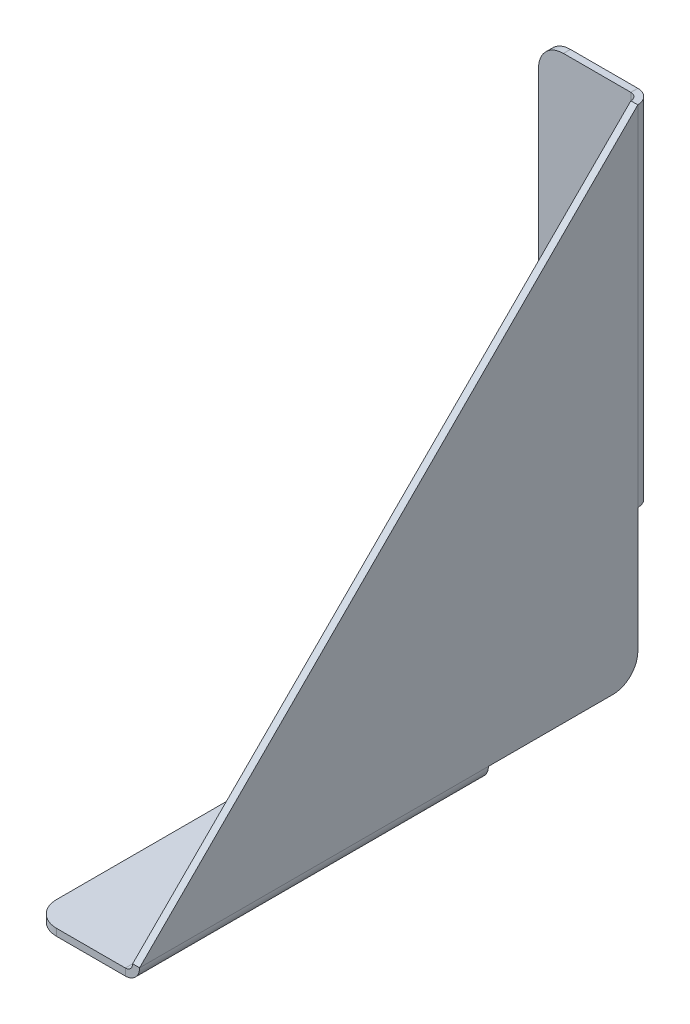
ISO-10303-21;
HEADER;
FILE_DESCRIPTION(('STEP AP214'),'2;1');
FILE_NAME('part.step','',(''),(''),'','','');
FILE_SCHEMA(('AUTOMOTIVE_DESIGN { 1 0 10303 214 1 1 1 1 }'));
ENDSEC;
DATA;
#1=APPLICATION_CONTEXT('core data for automotive mechanical design processes');
#2=APPLICATION_PROTOCOL_DEFINITION('international standard','automotive_design',2000,#1);
#3=PRODUCT_CONTEXT('',#1,'mechanical');
#4=PRODUCT('Part','Part','',(#3));
#5=PRODUCT_RELATED_PRODUCT_CATEGORY('part','',(#4));
#6=PRODUCT_DEFINITION_FORMATION('','',#4);
#7=PRODUCT_DEFINITION_CONTEXT('part definition',#1,'design');
#8=PRODUCT_DEFINITION('design','',#6,#7);
#9=PRODUCT_DEFINITION_SHAPE('','',#8);
#10=(LENGTH_UNIT() NAMED_UNIT(*) SI_UNIT(.MILLI.,.METRE.));
#11=(NAMED_UNIT(*) PLANE_ANGLE_UNIT() SI_UNIT($,.RADIAN.));
#12=(NAMED_UNIT(*) SI_UNIT($,.STERADIAN.) SOLID_ANGLE_UNIT());
#13=UNCERTAINTY_MEASURE_WITH_UNIT(LENGTH_MEASURE(1.E-05),#10,'distance_accuracy_value','');
#14=(GEOMETRIC_REPRESENTATION_CONTEXT(3) GLOBAL_UNCERTAINTY_ASSIGNED_CONTEXT((#13)) GLOBAL_UNIT_ASSIGNED_CONTEXT((#10,
#11,#12)) REPRESENTATION_CONTEXT('',''));
#15=CARTESIAN_POINT('',(0.,0.,0.));
#16=DIRECTION('',(0.,0.,1.));
#17=DIRECTION('',(1.,0.,0.));
#18=AXIS2_PLACEMENT_3D('',#15,#16,#17);
#19=CARTESIAN_POINT('',(-0.7,50.,-50.));
#20=DIRECTION('',(0.,0.,-1.));
#21=DIRECTION('',(0.,1.,0.));
#22=AXIS2_PLACEMENT_3D('',#19,#20,#21);
#23=PLANE('',#22);
#24=DIRECTION('',(0.,1.,0.));
#25=VECTOR('',#24,1.);
#26=CARTESIAN_POINT('',(0.,50.,-50.));
#27=LINE('',#26,#25);
#28=CARTESIAN_POINT('',(0.,2.5,-50.));
#29=VERTEX_POINT('',#28);
#30=CARTESIAN_POINT('',(0.,15.,-50.));
#31=VERTEX_POINT('',#30);
#32=EDGE_CURVE('E301',#29,#31,#27,.T.);
#33=ORIENTED_EDGE('',*,*,#32,.F.);
#34=DIRECTION('',(1.,0.,0.));
#35=VECTOR('',#34,1.);
#36=CARTESIAN_POINT('',(-0.7,2.5,-50.));
#37=LINE('',#36,#35);
#38=CARTESIAN_POINT('',(-0.7,2.5,-50.));
#39=VERTEX_POINT('',#38);
#40=EDGE_CURVE('E434',#29,#39,#37,.F.);
#41=ORIENTED_EDGE('',*,*,#40,.T.);
#42=DIRECTION('',(0.,1.,0.));
#43=VECTOR('',#42,1.);
#44=CARTESIAN_POINT('',(-0.7,50.,-50.));
#45=LINE('',#44,#43);
#46=CARTESIAN_POINT('',(-0.699999999999998,15.,-50.));
#47=VERTEX_POINT('',#46);
#48=EDGE_CURVE('E431',#39,#47,#45,.T.);
#49=ORIENTED_EDGE('',*,*,#48,.T.);
#50=DIRECTION('',(1.,0.,0.));
#51=VECTOR('',#50,1.);
#52=CARTESIAN_POINT('',(-0.699999999999998,15.,-50.));
#53=LINE('',#52,#51);
#54=EDGE_CURVE('E330',#47,#31,#53,.T.);
#55=ORIENTED_EDGE('',*,*,#54,.T.);
#56=EDGE_LOOP('',(#33,#41,#49,#55));
#57=FACE_BOUND('',#56,.T.);
#58=ADVANCED_FACE('F76',(#57),#23,.T.);
#59=CARTESIAN_POINT('',(-0.7,0.,-50.));
#60=DIRECTION('',(0.,-1.,0.));
#61=DIRECTION('',(0.,0.,-1.));
#62=AXIS2_PLACEMENT_3D('',#59,#60,#61);
#63=PLANE('',#62);
#64=DIRECTION('',(0.,0.,-1.));
#65=VECTOR('',#64,1.);
#66=CARTESIAN_POINT('',(-0.7,0.,-50.));
#67=LINE('',#66,#65);
#68=CARTESIAN_POINT('',(-0.7,0.,-35.));
#69=VERTEX_POINT('',#68);
#70=CARTESIAN_POINT('',(-0.7,0.,-47.5));
#71=VERTEX_POINT('',#70);
#72=EDGE_CURVE('E313',#69,#71,#67,.T.);
#73=ORIENTED_EDGE('',*,*,#72,.T.);
#74=DIRECTION('',(1.,0.,0.));
#75=VECTOR('',#74,1.);
#76=CARTESIAN_POINT('',(-0.7,0.,-47.5));
#77=LINE('',#76,#75);
#78=CARTESIAN_POINT('',(0.,0.,-47.5));
#79=VERTEX_POINT('',#78);
#80=EDGE_CURVE('E297',#71,#79,#77,.T.);
#81=ORIENTED_EDGE('',*,*,#80,.T.);
#82=DIRECTION('',(0.,0.,-1.));
#83=VECTOR('',#82,1.);
#84=CARTESIAN_POINT('',(0.,0.,-50.));
#85=LINE('',#84,#83);
#86=CARTESIAN_POINT('',(0.,0.,-35.));
#87=VERTEX_POINT('',#86);
#88=EDGE_CURVE('E334',#87,#79,#85,.T.);
#89=ORIENTED_EDGE('',*,*,#88,.F.);
#90=DIRECTION('',(1.,0.,0.));
#91=VECTOR('',#90,1.);
#92=CARTESIAN_POINT('',(-0.699999999999994,0.,-35.));
#93=LINE('',#92,#91);
#94=EDGE_CURVE('E264',#69,#87,#93,.T.);
#95=ORIENTED_EDGE('',*,*,#94,.F.);
#96=EDGE_LOOP('',(#73,#81,#89,#95));
#97=FACE_BOUND('',#96,.T.);
#98=ADVANCED_FACE('F455',(#97),#63,.T.);
#99=CARTESIAN_POINT('',(-0.7,0.,0.));
#100=DIRECTION('',(0.,0.707106781186547,0.707106781186548));
#101=DIRECTION('',(0.,-0.707106781186548,0.707106781186547));
#102=AXIS2_PLACEMENT_3D('',#99,#100,#101);
#103=PLANE('',#102);
#104=DIRECTION('',(0.,-0.707106781186548,0.707106781186547));
#105=VECTOR('',#104,1.);
#106=CARTESIAN_POINT('',(0.,0.,0.));
#107=LINE('',#106,#105);
#108=CARTESIAN_POINT('',(0.,50.,-50.));
#109=VERTEX_POINT('',#108);
#110=CARTESIAN_POINT('',(0.,0.,0.));
#111=VERTEX_POINT('',#110);
#112=EDGE_CURVE('E304',#109,#111,#107,.T.);
#113=ORIENTED_EDGE('',*,*,#112,.F.);
#114=DIRECTION('',(1.,0.,0.));
#115=VECTOR('',#114,1.);
#116=CARTESIAN_POINT('',(-0.7,50.,-50.));
#117=LINE('',#116,#115);
#118=CARTESIAN_POINT('',(-0.700000000000008,50.,-50.));
#119=VERTEX_POINT('',#118);
#120=EDGE_CURVE('E315',#119,#109,#117,.T.);
#121=ORIENTED_EDGE('',*,*,#120,.F.);
#122=DIRECTION('',(0.,-0.707106781186548,0.707106781186547));
#123=VECTOR('',#122,1.);
#124=CARTESIAN_POINT('',(-0.7,0.,0.));
#125=LINE('',#124,#123);
#126=CARTESIAN_POINT('',(-0.7,0.,0.));
#127=VERTEX_POINT('',#126);
#128=EDGE_CURVE('E317',#119,#127,#125,.T.);
#129=ORIENTED_EDGE('',*,*,#128,.T.);
#130=DIRECTION('',(1.,0.,0.));
#131=VECTOR('',#130,1.);
#132=CARTESIAN_POINT('',(-0.7,0.,0.));
#133=LINE('',#132,#131);
#134=EDGE_CURVE('E283',#127,#111,#133,.T.);
#135=ORIENTED_EDGE('',*,*,#134,.T.);
#136=EDGE_LOOP('',(#113,#121,#129,#135));
#137=FACE_BOUND('',#136,.T.);
#138=ADVANCED_FACE('F425',(#137),#103,.T.);
#139=CARTESIAN_POINT('',(-0.7,0.,0.));
#140=DIRECTION('',(1.,0.,0.));
#141=DIRECTION('',(0.,0.,-1.));
#142=AXIS2_PLACEMENT_3D('',#139,#140,#141);
#143=PLANE('',#142);
#144=ORIENTED_EDGE('',*,*,#48,.F.);
#145=CARTESIAN_POINT('',(-0.7,2.5,-47.5));
#146=DIRECTION('',(1.,0.,0.));
#147=DIRECTION('',(0.,0.,-1.));
#148=AXIS2_PLACEMENT_3D('',#145,#146,#147);
#149=CIRCLE('',#148,2.5);
#150=EDGE_CURVE('E436',#39,#71,#149,.F.);
#151=ORIENTED_EDGE('',*,*,#150,.T.);
#152=ORIENTED_EDGE('',*,*,#72,.F.);
#153=EDGE_CURVE('E269',#127,#69,#67,.T.);
#154=ORIENTED_EDGE('',*,*,#153,.F.);
#155=ORIENTED_EDGE('',*,*,#128,.F.);
#156=DIRECTION('',(0.,-1.,0.));
#157=VECTOR('',#156,1.);
#158=CARTESIAN_POINT('',(-0.699999999999998,15.,-50.));
#159=LINE('',#158,#157);
#160=EDGE_CURVE('E351',#47,#119,#159,.F.);
#161=ORIENTED_EDGE('',*,*,#160,.F.);
#162=EDGE_LOOP('',(#144,#151,#152,#154,#155,#161));
#163=FACE_BOUND('',#162,.T.);
#164=ADVANCED_FACE('F428',(#163),#143,.F.);
#165=CARTESIAN_POINT('',(0.,0.,0.));
#166=DIRECTION('',(1.,0.,0.));
#167=DIRECTION('',(0.,0.,-1.));
#168=AXIS2_PLACEMENT_3D('',#165,#166,#167);
#169=PLANE('',#168);
#170=ORIENTED_EDGE('',*,*,#88,.T.);
#171=CARTESIAN_POINT('',(0.,2.5,-47.5));
#172=DIRECTION('',(1.,0.,0.));
#173=DIRECTION('',(0.,0.,-1.));
#174=AXIS2_PLACEMENT_3D('',#171,#172,#173);
#175=CIRCLE('',#174,2.5);
#176=EDGE_CURVE('E300',#79,#29,#175,.T.);
#177=ORIENTED_EDGE('',*,*,#176,.T.);
#178=ORIENTED_EDGE('',*,*,#32,.T.);
#179=DIRECTION('',(0.,-1.,0.));
#180=VECTOR('',#179,1.);
#181=CARTESIAN_POINT('',(0.,15.,-50.));
#182=LINE('',#181,#180);
#183=EDGE_CURVE('E321',#31,#109,#182,.F.);
#184=ORIENTED_EDGE('',*,*,#183,.T.);
#185=ORIENTED_EDGE('',*,*,#112,.T.);
#186=EDGE_CURVE('E212',#111,#87,#85,.T.);
#187=ORIENTED_EDGE('',*,*,#186,.T.);
#188=EDGE_LOOP('',(#170,#177,#178,#184,#185,#187));
#189=FACE_BOUND('',#188,.T.);
#190=ADVANCED_FACE('F637',(#189),#169,.T.);
#191=CARTESIAN_POINT('',(-1.4366,50.,-50.));
#192=DIRECTION('',(0.,1.,0.));
#193=DIRECTION('',(-1.,0.,0.));
#194=AXIS2_PLACEMENT_3D('',#191,#192,#193);
#195=PLANE('',#194);
#196=DIRECTION('',(0.,0.,-1.));
#197=VECTOR('',#196,1.);
#198=CARTESIAN_POINT('',(-1.4366,50.,-51.4366));
#199=LINE('',#198,#197);
#200=CARTESIAN_POINT('',(-1.4366,50.,-50.7366));
#201=VERTEX_POINT('',#200);
#202=CARTESIAN_POINT('',(-1.43659999999999,50.,-51.4366));
#203=VERTEX_POINT('',#202);
#204=EDGE_CURVE('E268',#201,#203,#199,.T.);
#205=ORIENTED_EDGE('',*,*,#204,.F.);
#206=CARTESIAN_POINT('',(-1.4366,50.,-50.));
#207=DIRECTION('',(0.,-1.,0.));
#208=DIRECTION('',(1.,0.,0.));
#209=AXIS2_PLACEMENT_3D('',#206,#207,#208);
#210=CIRCLE('',#209,0.73659999999999);
#211=EDGE_CURVE('E322',#119,#201,#210,.F.);
#212=ORIENTED_EDGE('',*,*,#211,.F.);
#213=ORIENTED_EDGE('',*,*,#120,.T.);
#214=CARTESIAN_POINT('',(-1.4366,50.,-50.));
#215=DIRECTION('',(0.,-1.,0.));
#216=DIRECTION('',(1.,0.,0.));
#217=AXIS2_PLACEMENT_3D('',#214,#215,#216);
#218=CIRCLE('',#217,1.43659999999999);
#219=EDGE_CURVE('E327',#109,#203,#218,.F.);
#220=ORIENTED_EDGE('',*,*,#219,.T.);
#221=EDGE_LOOP('',(#205,#212,#213,#220));
#222=FACE_BOUND('',#221,.T.);
#223=ADVANCED_FACE('F390',(#222),#195,.T.);
#224=CARTESIAN_POINT('',(-1.43659999999999,15.,-50.));
#225=DIRECTION('',(0.,1.,0.));
#226=DIRECTION('',(-1.,0.,0.));
#227=AXIS2_PLACEMENT_3D('',#224,#225,#226);
#228=PLANE('',#227);
#229=CARTESIAN_POINT('',(-1.43659999999999,15.,-50.));
#230=DIRECTION('',(0.,-1.,0.));
#231=DIRECTION('',(1.,0.,0.));
#232=AXIS2_PLACEMENT_3D('',#229,#230,#231);
#233=CIRCLE('',#232,0.73659999999999);
#234=CARTESIAN_POINT('',(-1.43659999999999,15.,-50.7366));
#235=VERTEX_POINT('',#234);
#236=EDGE_CURVE('E335',#235,#47,#233,.T.);
#237=ORIENTED_EDGE('',*,*,#236,.F.);
#238=DIRECTION('',(0.,0.,-1.));
#239=VECTOR('',#238,1.);
#240=CARTESIAN_POINT('',(-1.43659999999999,15.,-50.7366));
#241=LINE('',#240,#239);
#242=CARTESIAN_POINT('',(-1.43659999999999,15.,-51.4366));
#243=VERTEX_POINT('',#242);
#244=EDGE_CURVE('E381',#235,#243,#241,.T.);
#245=ORIENTED_EDGE('',*,*,#244,.T.);
#246=CARTESIAN_POINT('',(-1.43659999999999,15.,-50.));
#247=DIRECTION('',(0.,-1.,0.));
#248=DIRECTION('',(1.,0.,0.));
#249=AXIS2_PLACEMENT_3D('',#246,#247,#248);
#250=CIRCLE('',#249,1.43659999999999);
#251=EDGE_CURVE('E318',#243,#31,#250,.T.);
#252=ORIENTED_EDGE('',*,*,#251,.T.);
#253=ORIENTED_EDGE('',*,*,#54,.F.);
#254=EDGE_LOOP('',(#237,#245,#252,#253));
#255=FACE_BOUND('',#254,.T.);
#256=ADVANCED_FACE('F403',(#255),#228,.F.);
#257=CARTESIAN_POINT('',(-1.43659999999999,15.,-50.));
#258=DIRECTION('',(0.,-1.,0.));
#259=DIRECTION('',(0.,0.,-1.));
#260=AXIS2_PLACEMENT_3D('',#257,#258,#259);
#261=CYLINDRICAL_SURFACE('',#260,1.43659999999999);
#262=ORIENTED_EDGE('',*,*,#183,.F.);
#263=ORIENTED_EDGE('',*,*,#251,.F.);
#264=DIRECTION('',(0.,-1.,0.));
#265=VECTOR('',#264,1.);
#266=CARTESIAN_POINT('',(-1.43659999999999,0.,-51.4366));
#267=LINE('',#266,#265);
#268=EDGE_CURVE('E378',#203,#243,#267,.T.);
#269=ORIENTED_EDGE('',*,*,#268,.F.);
#270=ORIENTED_EDGE('',*,*,#219,.F.);
#271=EDGE_LOOP('',(#262,#263,#269,#270));
#272=FACE_BOUND('',#271,.T.);
#273=ADVANCED_FACE('F400',(#272),#261,.T.);
#274=CARTESIAN_POINT('',(-1.43659999999999,15.,-50.));
#275=DIRECTION('',(0.,-1.,0.));
#276=DIRECTION('',(0.,0.,-1.));
#277=AXIS2_PLACEMENT_3D('',#274,#275,#276);
#278=CYLINDRICAL_SURFACE('',#277,0.73659999999999);
#279=ORIENTED_EDGE('',*,*,#160,.T.);
#280=ORIENTED_EDGE('',*,*,#211,.T.);
#281=DIRECTION('',(0.,1.,0.));
#282=VECTOR('',#281,1.);
#283=CARTESIAN_POINT('',(-1.4366,50.,-50.7366));
#284=LINE('',#283,#282);
#285=EDGE_CURVE('E384',#201,#235,#284,.F.);
#286=ORIENTED_EDGE('',*,*,#285,.T.);
#287=ORIENTED_EDGE('',*,*,#236,.T.);
#288=EDGE_LOOP('',(#279,#280,#286,#287));
#289=FACE_BOUND('',#288,.T.);
#290=ADVANCED_FACE('F420',(#289),#278,.F.);
#291=CARTESIAN_POINT('',(-0.699999999999991,15.,-51.4366));
#292=DIRECTION('',(0.,-1.,0.));
#293=DIRECTION('',(0.,0.,-1.));
#294=AXIS2_PLACEMENT_3D('',#291,#292,#293);
#295=PLANE('',#294);
#296=DIRECTION('',(-1.,0.,0.));
#297=VECTOR('',#296,1.);
#298=CARTESIAN_POINT('',(1.73472347597681E-13,15.,-50.7366));
#299=LINE('',#298,#297);
#300=CARTESIAN_POINT('',(-8.2,15.,-50.7366));
#301=VERTEX_POINT('',#300);
#302=EDGE_CURVE('E368',#301,#235,#299,.F.);
#303=ORIENTED_EDGE('',*,*,#302,.F.);
#304=DIRECTION('',(0.,0.,1.));
#305=VECTOR('',#304,1.);
#306=CARTESIAN_POINT('',(-8.2,15.,-51.4366));
#307=LINE('',#306,#305);
#308=CARTESIAN_POINT('',(-8.2,15.,-51.4366));
#309=VERTEX_POINT('',#308);
#310=EDGE_CURVE('E99',#301,#309,#307,.F.);
#311=ORIENTED_EDGE('',*,*,#310,.T.);
#312=DIRECTION('',(1.,0.,0.));
#313=VECTOR('',#312,1.);
#314=CARTESIAN_POINT('',(-0.699999999999991,15.,-51.4366));
#315=LINE('',#314,#313);
#316=EDGE_CURVE('E261',#309,#243,#315,.T.);
#317=ORIENTED_EDGE('',*,*,#316,.T.);
#318=ORIENTED_EDGE('',*,*,#244,.F.);
#319=EDGE_LOOP('',(#303,#311,#317,#318));
#320=FACE_BOUND('',#319,.T.);
#321=ADVANCED_FACE('F404',(#320),#295,.T.);
#322=CARTESIAN_POINT('',(-10.7,50.,-51.4366));
#323=DIRECTION('',(0.,1.,0.));
#324=DIRECTION('',(0.,0.,1.));
#325=AXIS2_PLACEMENT_3D('',#322,#323,#324);
#326=PLANE('',#325);
#327=DIRECTION('',(-1.,0.,0.));
#328=VECTOR('',#327,1.);
#329=CARTESIAN_POINT('',(-10.7,50.,-51.4366));
#330=LINE('',#329,#328);
#331=CARTESIAN_POINT('',(-8.2,50.,-51.4366));
#332=VERTEX_POINT('',#331);
#333=EDGE_CURVE('E364',#203,#332,#330,.T.);
#334=ORIENTED_EDGE('',*,*,#333,.T.);
#335=DIRECTION('',(0.,0.,1.));
#336=VECTOR('',#335,1.);
#337=CARTESIAN_POINT('',(-8.2,50.,-51.4366));
#338=LINE('',#337,#336);
#339=CARTESIAN_POINT('',(-8.2,50.,-50.7366));
#340=VERTEX_POINT('',#339);
#341=EDGE_CURVE('E13',#332,#340,#338,.T.);
#342=ORIENTED_EDGE('',*,*,#341,.T.);
#343=DIRECTION('',(1.,0.,0.));
#344=VECTOR('',#343,1.);
#345=CARTESIAN_POINT('',(1.73472347597681E-13,50.,-50.7366));
#346=LINE('',#345,#344);
#347=EDGE_CURVE('E375',#201,#340,#346,.F.);
#348=ORIENTED_EDGE('',*,*,#347,.F.);
#349=ORIENTED_EDGE('',*,*,#204,.T.);
#350=EDGE_LOOP('',(#334,#342,#348,#349));
#351=FACE_BOUND('',#350,.T.);
#352=ADVANCED_FACE('F396',(#351),#326,.T.);
#353=CARTESIAN_POINT('',(1.75916384534871E-13,0.,-51.4366));
#354=DIRECTION('',(0.,0.,-1.));
#355=DIRECTION('',(-1.,0.,0.));
#356=AXIS2_PLACEMENT_3D('',#353,#354,#355);
#357=PLANE('',#356);
#358=ORIENTED_EDGE('',*,*,#316,.F.);
#359=CARTESIAN_POINT('',(-8.2,17.5,-51.4366));
#360=DIRECTION('',(0.,0.,-1.));
#361=DIRECTION('',(-1.,0.,0.));
#362=AXIS2_PLACEMENT_3D('',#359,#360,#361);
#363=CIRCLE('',#362,2.5);
#364=CARTESIAN_POINT('',(-10.7,17.5,-51.4366));
#365=VERTEX_POINT('',#364);
#366=EDGE_CURVE('E84',#309,#365,#363,.T.);
#367=ORIENTED_EDGE('',*,*,#366,.T.);
#368=DIRECTION('',(0.,-1.,0.));
#369=VECTOR('',#368,1.);
#370=CARTESIAN_POINT('',(-10.7,15.,-51.4366));
#371=LINE('',#370,#369);
#372=CARTESIAN_POINT('',(-10.7,47.5,-51.4366));
#373=VERTEX_POINT('',#372);
#374=EDGE_CURVE('E360',#373,#365,#371,.T.);
#375=ORIENTED_EDGE('',*,*,#374,.F.);
#376=CARTESIAN_POINT('',(-8.2,47.5,-51.4366));
#377=DIRECTION('',(0.,0.,-1.));
#378=DIRECTION('',(-1.,0.,0.));
#379=AXIS2_PLACEMENT_3D('',#376,#377,#378);
#380=CIRCLE('',#379,2.5);
#381=EDGE_CURVE('E91',#373,#332,#380,.T.);
#382=ORIENTED_EDGE('',*,*,#381,.T.);
#383=ORIENTED_EDGE('',*,*,#333,.F.);
#384=ORIENTED_EDGE('',*,*,#268,.T.);
#385=EDGE_LOOP('',(#358,#367,#375,#382,#383,#384));
#386=FACE_BOUND('',#385,.T.);
#387=ADVANCED_FACE('F398',(#386),#357,.T.);
#388=CARTESIAN_POINT('',(1.73472347597681E-13,0.,-50.7366));
#389=DIRECTION('',(0.,0.,-1.));
#390=DIRECTION('',(-1.,0.,0.));
#391=AXIS2_PLACEMENT_3D('',#388,#389,#390);
#392=PLANE('',#391);
#393=DIRECTION('',(0.,1.,0.));
#394=VECTOR('',#393,1.);
#395=CARTESIAN_POINT('',(-10.7,0.,-50.7366));
#396=LINE('',#395,#394);
#397=CARTESIAN_POINT('',(-10.7,47.5,-50.7366));
#398=VERTEX_POINT('',#397);
#399=CARTESIAN_POINT('',(-10.7,17.5,-50.7366));
#400=VERTEX_POINT('',#399);
#401=EDGE_CURVE('E372',#398,#400,#396,.F.);
#402=ORIENTED_EDGE('',*,*,#401,.T.);
#403=CARTESIAN_POINT('',(-8.2,17.5,-50.7366));
#404=DIRECTION('',(0.,0.,-1.));
#405=DIRECTION('',(-1.,0.,0.));
#406=AXIS2_PLACEMENT_3D('',#403,#404,#405);
#407=CIRCLE('',#406,2.5);
#408=EDGE_CURVE('E409',#400,#301,#407,.F.);
#409=ORIENTED_EDGE('',*,*,#408,.T.);
#410=ORIENTED_EDGE('',*,*,#302,.T.);
#411=ORIENTED_EDGE('',*,*,#285,.F.);
#412=ORIENTED_EDGE('',*,*,#347,.T.);
#413=CARTESIAN_POINT('',(-8.2,47.5,-50.7366));
#414=DIRECTION('',(0.,0.,-1.));
#415=DIRECTION('',(-1.,0.,0.));
#416=AXIS2_PLACEMENT_3D('',#413,#414,#415);
#417=CIRCLE('',#416,2.5);
#418=EDGE_CURVE('E412',#340,#398,#417,.F.);
#419=ORIENTED_EDGE('',*,*,#418,.T.);
#420=EDGE_LOOP('',(#402,#409,#410,#411,#412,#419));
#421=FACE_BOUND('',#420,.T.);
#422=ADVANCED_FACE('F418',(#421),#392,.F.);
#423=CARTESIAN_POINT('',(-10.7,15.,-51.4366));
#424=DIRECTION('',(-1.,0.,0.));
#425=DIRECTION('',(0.,0.,1.));
#426=AXIS2_PLACEMENT_3D('',#423,#424,#425);
#427=PLANE('',#426);
#428=ORIENTED_EDGE('',*,*,#374,.T.);
#429=DIRECTION('',(0.,0.,1.));
#430=VECTOR('',#429,1.);
#431=CARTESIAN_POINT('',(-10.7,17.5,-51.4366));
#432=LINE('',#431,#430);
#433=EDGE_CURVE('E439',#365,#400,#432,.T.);
#434=ORIENTED_EDGE('',*,*,#433,.T.);
#435=ORIENTED_EDGE('',*,*,#401,.F.);
#436=DIRECTION('',(0.,0.,1.));
#437=VECTOR('',#436,1.);
#438=CARTESIAN_POINT('',(-10.7,47.5,-51.4366));
#439=LINE('',#438,#437);
#440=EDGE_CURVE('E417',#398,#373,#439,.F.);
#441=ORIENTED_EDGE('',*,*,#440,.T.);
#442=EDGE_LOOP('',(#428,#434,#435,#441));
#443=FACE_BOUND('',#442,.T.);
#444=ADVANCED_FACE('F440',(#443),#427,.T.);
#445=CARTESIAN_POINT('',(-1.43659999999999,0.,-35.));
#446=DIRECTION('',(0.,0.,-1.));
#447=DIRECTION('',(-1.,0.,0.));
#448=AXIS2_PLACEMENT_3D('',#445,#446,#447);
#449=PLANE('',#448);
#450=DIRECTION('',(0.,1.,0.));
#451=VECTOR('',#450,1.);
#452=CARTESIAN_POINT('',(-1.43659999999999,-1.4366,-35.));
#453=LINE('',#452,#451);
#454=CARTESIAN_POINT('',(-1.43659999999999,-0.7366,-35.));
#455=VERTEX_POINT('',#454);
#456=CARTESIAN_POINT('',(-1.43659999999999,-1.4366,-35.));
#457=VERTEX_POINT('',#456);
#458=EDGE_CURVE('E255',#455,#457,#453,.F.);
#459=ORIENTED_EDGE('',*,*,#458,.F.);
#460=CARTESIAN_POINT('',(-1.43659999999999,0.,-35.));
#461=DIRECTION('',(0.,0.,1.));
#462=DIRECTION('',(1.,0.,0.));
#463=AXIS2_PLACEMENT_3D('',#460,#461,#462);
#464=CIRCLE('',#463,0.7366);
#465=EDGE_CURVE('E216',#69,#455,#464,.F.);
#466=ORIENTED_EDGE('',*,*,#465,.F.);
#467=ORIENTED_EDGE('',*,*,#94,.T.);
#468=CARTESIAN_POINT('',(-1.43659999999999,0.,-35.));
#469=DIRECTION('',(0.,0.,1.));
#470=DIRECTION('',(1.,0.,0.));
#471=AXIS2_PLACEMENT_3D('',#468,#469,#470);
#472=CIRCLE('',#471,1.4366);
#473=EDGE_CURVE('E215',#87,#457,#472,.F.);
#474=ORIENTED_EDGE('',*,*,#473,.T.);
#475=EDGE_LOOP('',(#459,#466,#467,#474));
#476=FACE_BOUND('',#475,.T.);
#477=ADVANCED_FACE('F442',(#476),#449,.T.);
#478=CARTESIAN_POINT('',(-1.4366,0.,0.));
#479=DIRECTION('',(0.,0.,-1.));
#480=DIRECTION('',(-1.,0.,0.));
#481=AXIS2_PLACEMENT_3D('',#478,#479,#480);
#482=PLANE('',#481);
#483=CARTESIAN_POINT('',(-1.4366,0.,0.));
#484=DIRECTION('',(0.,0.,1.));
#485=DIRECTION('',(1.,0.,0.));
#486=AXIS2_PLACEMENT_3D('',#483,#484,#485);
#487=CIRCLE('',#486,0.7366);
#488=CARTESIAN_POINT('',(-1.4366,-0.7366,0.));
#489=VERTEX_POINT('',#488);
#490=EDGE_CURVE('E223',#489,#127,#487,.T.);
#491=ORIENTED_EDGE('',*,*,#490,.F.);
#492=DIRECTION('',(0.,1.,0.));
#493=VECTOR('',#492,1.);
#494=CARTESIAN_POINT('',(-1.4366,-0.7366,0.));
#495=LINE('',#494,#493);
#496=CARTESIAN_POINT('',(-1.43659999999999,-1.4366,0.));
#497=VERTEX_POINT('',#496);
#498=EDGE_CURVE('E220',#489,#497,#495,.F.);
#499=ORIENTED_EDGE('',*,*,#498,.T.);
#500=CARTESIAN_POINT('',(-1.4366,0.,0.));
#501=DIRECTION('',(0.,0.,1.));
#502=DIRECTION('',(1.,0.,0.));
#503=AXIS2_PLACEMENT_3D('',#500,#501,#502);
#504=CIRCLE('',#503,1.4366);
#505=EDGE_CURVE('E205',#497,#111,#504,.T.);
#506=ORIENTED_EDGE('',*,*,#505,.T.);
#507=ORIENTED_EDGE('',*,*,#134,.F.);
#508=EDGE_LOOP('',(#491,#499,#506,#507));
#509=FACE_BOUND('',#508,.T.);
#510=ADVANCED_FACE('F221',(#509),#482,.F.);
#511=CARTESIAN_POINT('',(-1.4366,0.,0.));
#512=DIRECTION('',(0.,0.,1.));
#513=DIRECTION('',(0.,-1.,0.));
#514=AXIS2_PLACEMENT_3D('',#511,#512,#513);
#515=CYLINDRICAL_SURFACE('',#514,1.4366);
#516=ORIENTED_EDGE('',*,*,#186,.F.);
#517=ORIENTED_EDGE('',*,*,#505,.F.);
#518=DIRECTION('',(0.,0.,1.));
#519=VECTOR('',#518,1.);
#520=CARTESIAN_POINT('',(-1.43659999999999,-1.4366,-35.));
#521=LINE('',#520,#519);
#522=EDGE_CURVE('E210',#497,#457,#521,.F.);
#523=ORIENTED_EDGE('',*,*,#522,.T.);
#524=ORIENTED_EDGE('',*,*,#473,.F.);
#525=EDGE_LOOP('',(#516,#517,#523,#524));
#526=FACE_BOUND('',#525,.T.);
#527=ADVANCED_FACE('F207',(#526),#515,.T.);
#528=CARTESIAN_POINT('',(-1.4366,0.,0.));
#529=DIRECTION('',(0.,0.,1.));
#530=DIRECTION('',(0.,-1.,0.));
#531=AXIS2_PLACEMENT_3D('',#528,#529,#530);
#532=CYLINDRICAL_SURFACE('',#531,0.7366);
#533=ORIENTED_EDGE('',*,*,#153,.T.);
#534=ORIENTED_EDGE('',*,*,#465,.T.);
#535=DIRECTION('',(0.,0.,1.));
#536=VECTOR('',#535,1.);
#537=CARTESIAN_POINT('',(-1.43659999999999,-0.7366,-35.));
#538=LINE('',#537,#536);
#539=EDGE_CURVE('E228',#455,#489,#538,.T.);
#540=ORIENTED_EDGE('',*,*,#539,.T.);
#541=ORIENTED_EDGE('',*,*,#490,.T.);
#542=EDGE_LOOP('',(#533,#534,#540,#541));
#543=FACE_BOUND('',#542,.T.);
#544=ADVANCED_FACE('F547',(#543),#532,.F.);
#545=CARTESIAN_POINT('',(-10.8366,-1.43660000000003,0.));
#546=DIRECTION('',(0.,0.,-1.));
#547=DIRECTION('',(0.,1.,0.));
#548=AXIS2_PLACEMENT_3D('',#545,#546,#547);
#549=PLANE('',#548);
#550=DIRECTION('',(1.,0.,0.));
#551=VECTOR('',#550,1.);
#552=CARTESIAN_POINT('',(-10.8366,-0.736600000000033,0.));
#553=LINE('',#552,#551);
#554=CARTESIAN_POINT('',(-8.3366,-0.736600000000024,0.));
#555=VERTEX_POINT('',#554);
#556=EDGE_CURVE('E238',#489,#555,#553,.F.);
#557=ORIENTED_EDGE('',*,*,#556,.T.);
#558=DIRECTION('',(0.,1.,0.));
#559=VECTOR('',#558,1.);
#560=CARTESIAN_POINT('',(-8.3366,-1.43660000000002,0.));
#561=LINE('',#560,#559);
#562=CARTESIAN_POINT('',(-8.3366,-1.43660000000002,0.));
#563=VERTEX_POINT('',#562);
#564=EDGE_CURVE('E242',#555,#563,#561,.F.);
#565=ORIENTED_EDGE('',*,*,#564,.T.);
#566=DIRECTION('',(-1.,0.,0.));
#567=VECTOR('',#566,1.);
#568=CARTESIAN_POINT('',(0.,-1.43659999999999,0.));
#569=LINE('',#568,#567);
#570=EDGE_CURVE('E234',#497,#563,#569,.T.);
#571=ORIENTED_EDGE('',*,*,#570,.F.);
#572=ORIENTED_EDGE('',*,*,#498,.F.);
#573=EDGE_LOOP('',(#557,#565,#571,#572));
#574=FACE_BOUND('',#573,.T.);
#575=ADVANCED_FACE('F240',(#574),#549,.F.);
#576=CARTESIAN_POINT('',(-0.699999999999991,-1.4366,-35.));
#577=DIRECTION('',(0.,0.,1.));
#578=DIRECTION('',(0.,-1.,0.));
#579=AXIS2_PLACEMENT_3D('',#576,#577,#578);
#580=PLANE('',#579);
#581=DIRECTION('',(1.,0.,0.));
#582=VECTOR('',#581,1.);
#583=CARTESIAN_POINT('',(0.,-1.4366,-35.));
#584=LINE('',#583,#582);
#585=CARTESIAN_POINT('',(-8.3366,-1.43660000000002,-35.));
#586=VERTEX_POINT('',#585);
#587=EDGE_CURVE('E237',#586,#457,#584,.T.);
#588=ORIENTED_EDGE('',*,*,#587,.F.);
#589=DIRECTION('',(0.,1.,0.));
#590=VECTOR('',#589,1.);
#591=CARTESIAN_POINT('',(-8.3366,-1.43660000000002,-35.));
#592=LINE('',#591,#590);
#593=CARTESIAN_POINT('',(-8.3366,-0.736600000000025,-35.));
#594=VERTEX_POINT('',#593);
#595=EDGE_CURVE('E279',#586,#594,#592,.T.);
#596=ORIENTED_EDGE('',*,*,#595,.T.);
#597=DIRECTION('',(-1.,0.,0.));
#598=VECTOR('',#597,1.);
#599=CARTESIAN_POINT('',(-0.699999999999994,-0.736599999999998,-35.));
#600=LINE('',#599,#598);
#601=EDGE_CURVE('E244',#594,#455,#600,.F.);
#602=ORIENTED_EDGE('',*,*,#601,.T.);
#603=ORIENTED_EDGE('',*,*,#458,.T.);
#604=EDGE_LOOP('',(#588,#596,#602,#603));
#605=FACE_BOUND('',#604,.T.);
#606=ADVANCED_FACE('F535',(#605),#580,.F.);
#607=CARTESIAN_POINT('',(0.,-1.43659999999999,0.));
#608=DIRECTION('',(0.,1.,0.));
#609=DIRECTION('',(-1.,0.,0.));
#610=AXIS2_PLACEMENT_3D('',#607,#608,#609);
#611=PLANE('',#610);
#612=DIRECTION('',(0.,0.,-1.));
#613=VECTOR('',#612,1.);
#614=CARTESIAN_POINT('',(-10.8366,-1.43660000000003,0.));
#615=LINE('',#614,#613);
#616=CARTESIAN_POINT('',(-10.8366,-1.43660000000003,-2.5));
#617=VERTEX_POINT('',#616);
#618=CARTESIAN_POINT('',(-10.8366,-1.43660000000003,-32.5));
#619=VERTEX_POINT('',#618);
#620=EDGE_CURVE('E243',#617,#619,#615,.T.);
#621=ORIENTED_EDGE('',*,*,#620,.T.);
#622=CARTESIAN_POINT('',(-8.3366,-1.43660000000002,-32.5));
#623=DIRECTION('',(0.,1.,0.));
#624=DIRECTION('',(-1.,0.,0.));
#625=AXIS2_PLACEMENT_3D('',#622,#623,#624);
#626=CIRCLE('',#625,2.5);
#627=EDGE_CURVE('E294',#619,#586,#626,.F.);
#628=ORIENTED_EDGE('',*,*,#627,.T.);
#629=ORIENTED_EDGE('',*,*,#587,.T.);
#630=ORIENTED_EDGE('',*,*,#522,.F.);
#631=ORIENTED_EDGE('',*,*,#570,.T.);
#632=CARTESIAN_POINT('',(-8.3366,-1.43660000000002,-2.5));
#633=DIRECTION('',(0.,1.,0.));
#634=DIRECTION('',(-1.,0.,0.));
#635=AXIS2_PLACEMENT_3D('',#632,#633,#634);
#636=CIRCLE('',#635,2.5);
#637=EDGE_CURVE('E292',#563,#617,#636,.F.);
#638=ORIENTED_EDGE('',*,*,#637,.T.);
#639=EDGE_LOOP('',(#621,#628,#629,#630,#631,#638));
#640=FACE_BOUND('',#639,.T.);
#641=ADVANCED_FACE('F233',(#640),#611,.F.);
#642=CARTESIAN_POINT('',(0.,-0.736599999999995,0.));
#643=DIRECTION('',(0.,1.,0.));
#644=DIRECTION('',(-1.,0.,0.));
#645=AXIS2_PLACEMENT_3D('',#642,#643,#644);
#646=PLANE('',#645);
#647=ORIENTED_EDGE('',*,*,#601,.F.);
#648=CARTESIAN_POINT('',(-8.3366,-0.736600000000025,-32.5));
#649=DIRECTION('',(0.,1.,0.));
#650=DIRECTION('',(-1.,0.,0.));
#651=AXIS2_PLACEMENT_3D('',#648,#649,#650);
#652=CIRCLE('',#651,2.5);
#653=CARTESIAN_POINT('',(-10.8366,-0.736600000000033,-32.5));
#654=VERTEX_POINT('',#653);
#655=EDGE_CURVE('E285',#594,#654,#652,.T.);
#656=ORIENTED_EDGE('',*,*,#655,.T.);
#657=DIRECTION('',(0.,0.,1.));
#658=VECTOR('',#657,1.);
#659=CARTESIAN_POINT('',(-10.8366,-0.736600000000033,-35.));
#660=LINE('',#659,#658);
#661=CARTESIAN_POINT('',(-10.8366,-0.736600000000033,-2.5));
#662=VERTEX_POINT('',#661);
#663=EDGE_CURVE('E247',#662,#654,#660,.F.);
#664=ORIENTED_EDGE('',*,*,#663,.F.);
#665=CARTESIAN_POINT('',(-8.3366,-0.736600000000024,-2.5));
#666=DIRECTION('',(0.,1.,0.));
#667=DIRECTION('',(-1.,0.,0.));
#668=AXIS2_PLACEMENT_3D('',#665,#666,#667);
#669=CIRCLE('',#668,2.5);
#670=EDGE_CURVE('E282',#662,#555,#669,.T.);
#671=ORIENTED_EDGE('',*,*,#670,.T.);
#672=ORIENTED_EDGE('',*,*,#556,.F.);
#673=ORIENTED_EDGE('',*,*,#539,.F.);
#674=EDGE_LOOP('',(#647,#656,#664,#671,#672,#673));
#675=FACE_BOUND('',#674,.T.);
#676=ADVANCED_FACE('F521',(#675),#646,.T.);
#677=CARTESIAN_POINT('',(-10.8366,-1.43660000000003,-35.));
#678=DIRECTION('',(1.,0.,0.));
#679=DIRECTION('',(0.,1.,0.));
#680=AXIS2_PLACEMENT_3D('',#677,#678,#679);
#681=PLANE('',#680);
#682=ORIENTED_EDGE('',*,*,#663,.T.);
#683=DIRECTION('',(0.,1.,0.));
#684=VECTOR('',#683,1.);
#685=CARTESIAN_POINT('',(-10.8366,-1.43660000000003,-32.5));
#686=LINE('',#685,#684);
#687=EDGE_CURVE('E290',#654,#619,#686,.F.);
#688=ORIENTED_EDGE('',*,*,#687,.T.);
#689=ORIENTED_EDGE('',*,*,#620,.F.);
#690=DIRECTION('',(0.,1.,0.));
#691=VECTOR('',#690,1.);
#692=CARTESIAN_POINT('',(-10.8366,-1.43660000000003,-2.5));
#693=LINE('',#692,#691);
#694=EDGE_CURVE('E287',#617,#662,#693,.T.);
#695=ORIENTED_EDGE('',*,*,#694,.T.);
#696=EDGE_LOOP('',(#682,#688,#689,#695));
#697=FACE_BOUND('',#696,.T.);
#698=ADVANCED_FACE('F471',(#697),#681,.F.);
#699=CARTESIAN_POINT('',(-8.3366,-1.43660000000002,-32.5));
#700=DIRECTION('',(0.,1.,0.));
#701=DIRECTION('',(-1.,0.,0.));
#702=AXIS2_PLACEMENT_3D('',#699,#700,#701);
#703=CYLINDRICAL_SURFACE('',#702,2.5);
#704=ORIENTED_EDGE('',*,*,#627,.F.);
#705=ORIENTED_EDGE('',*,*,#687,.F.);
#706=ORIENTED_EDGE('',*,*,#655,.F.);
#707=ORIENTED_EDGE('',*,*,#595,.F.);
#708=EDGE_LOOP('',(#704,#705,#706,#707));
#709=FACE_BOUND('',#708,.T.);
#710=ADVANCED_FACE('F467',(#709),#703,.T.);
#711=CARTESIAN_POINT('',(-8.3366,-1.43660000000002,-2.5));
#712=DIRECTION('',(0.,1.,0.));
#713=DIRECTION('',(-1.,0.,0.));
#714=AXIS2_PLACEMENT_3D('',#711,#712,#713);
#715=CYLINDRICAL_SURFACE('',#714,2.5);
#716=ORIENTED_EDGE('',*,*,#637,.F.);
#717=ORIENTED_EDGE('',*,*,#564,.F.);
#718=ORIENTED_EDGE('',*,*,#670,.F.);
#719=ORIENTED_EDGE('',*,*,#694,.F.);
#720=EDGE_LOOP('',(#716,#717,#718,#719));
#721=FACE_BOUND('',#720,.T.);
#722=ADVANCED_FACE('F470',(#721),#715,.T.);
#723=CARTESIAN_POINT('',(-0.7,2.5,-47.5));
#724=DIRECTION('',(1.,0.,0.));
#725=DIRECTION('',(0.,0.,-1.));
#726=AXIS2_PLACEMENT_3D('',#723,#724,#725);
#727=CYLINDRICAL_SURFACE('',#726,2.5);
#728=ORIENTED_EDGE('',*,*,#150,.F.);
#729=ORIENTED_EDGE('',*,*,#40,.F.);
#730=ORIENTED_EDGE('',*,*,#176,.F.);
#731=ORIENTED_EDGE('',*,*,#80,.F.);
#732=EDGE_LOOP('',(#728,#729,#730,#731));
#733=FACE_BOUND('',#732,.T.);
#734=ADVANCED_FACE('F475',(#733),#727,.T.);
#735=CARTESIAN_POINT('',(-8.2,17.5,-51.4366));
#736=DIRECTION('',(0.,0.,1.));
#737=DIRECTION('',(1.,0.,0.));
#738=AXIS2_PLACEMENT_3D('',#735,#736,#737);
#739=CYLINDRICAL_SURFACE('',#738,2.5);
#740=ORIENTED_EDGE('',*,*,#366,.F.);
#741=ORIENTED_EDGE('',*,*,#310,.F.);
#742=ORIENTED_EDGE('',*,*,#408,.F.);
#743=ORIENTED_EDGE('',*,*,#433,.F.);
#744=EDGE_LOOP('',(#740,#741,#742,#743));
#745=FACE_BOUND('',#744,.T.);
#746=ADVANCED_FACE('F408',(#745),#739,.T.);
#747=CARTESIAN_POINT('',(-8.2,47.5,-51.4366));
#748=DIRECTION('',(0.,0.,1.));
#749=DIRECTION('',(1.,0.,0.));
#750=AXIS2_PLACEMENT_3D('',#747,#748,#749);
#751=CYLINDRICAL_SURFACE('',#750,2.5);
#752=ORIENTED_EDGE('',*,*,#381,.F.);
#753=ORIENTED_EDGE('',*,*,#440,.F.);
#754=ORIENTED_EDGE('',*,*,#418,.F.);
#755=ORIENTED_EDGE('',*,*,#341,.F.);
#756=EDGE_LOOP('',(#752,#753,#754,#755));
#757=FACE_BOUND('',#756,.T.);
#758=ADVANCED_FACE('F78',(#757),#751,.T.);
#759=CLOSED_SHELL('',(#58,#98,#138,#164,#190,#223,#256,#273,#290,#321,#352,#387,#422,#444,#477,
#510,#527,#544,#575,#606,#641,#676,#698,#710,#722,#734,#746,#758));
#760=MANIFOLD_SOLID_BREP('B2',#759);
#761=ADVANCED_BREP_SHAPE_REPRESENTATION('',(#18,#760),#14);
#762=SHAPE_DEFINITION_REPRESENTATION(#9,#761);
ENDSEC;
END-ISO-10303-21;
